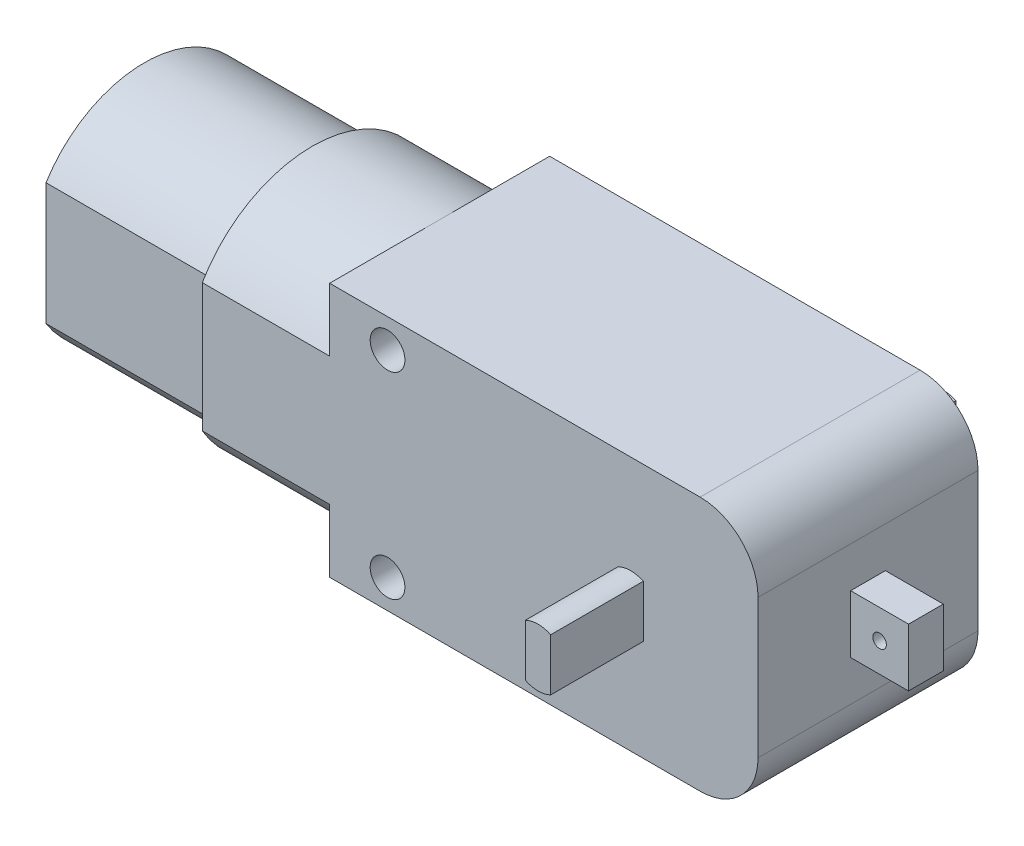
ISO-10303-21;
HEADER;
FILE_DESCRIPTION(('STEP AP214'),'2;1');
FILE_NAME('part.step','',(''),(''),'','','');
FILE_SCHEMA(('AUTOMOTIVE_DESIGN { 1 0 10303 214 1 1 1 1 }'));
ENDSEC;
DATA;
#1=APPLICATION_CONTEXT('core data for automotive mechanical design processes');
#2=APPLICATION_PROTOCOL_DEFINITION('international standard','automotive_design',2000,#1);
#3=PRODUCT_CONTEXT('',#1,'mechanical');
#4=PRODUCT('Part','Part','',(#3));
#5=PRODUCT_RELATED_PRODUCT_CATEGORY('part','',(#4));
#6=PRODUCT_DEFINITION_FORMATION('','',#4);
#7=PRODUCT_DEFINITION_CONTEXT('part definition',#1,'design');
#8=PRODUCT_DEFINITION('design','',#6,#7);
#9=PRODUCT_DEFINITION_SHAPE('','',#8);
#10=(LENGTH_UNIT() NAMED_UNIT(*) SI_UNIT(.MILLI.,.METRE.));
#11=(NAMED_UNIT(*) PLANE_ANGLE_UNIT() SI_UNIT($,.RADIAN.));
#12=(NAMED_UNIT(*) SI_UNIT($,.STERADIAN.) SOLID_ANGLE_UNIT());
#13=UNCERTAINTY_MEASURE_WITH_UNIT(LENGTH_MEASURE(1.E-05),#10,'distance_accuracy_value','');
#14=(GEOMETRIC_REPRESENTATION_CONTEXT(3) GLOBAL_UNCERTAINTY_ASSIGNED_CONTEXT((#13)) GLOBAL_UNIT_ASSIGNED_CONTEXT((#10,
#11,#12)) REPRESENTATION_CONTEXT('',''));
#15=CARTESIAN_POINT('',(0.,0.,0.));
#16=DIRECTION('',(0.,0.,1.));
#17=DIRECTION('',(1.,0.,0.));
#18=AXIS2_PLACEMENT_3D('',#15,#16,#17);
#19=CARTESIAN_POINT('',(-18.5,-11.,19.));
#20=DIRECTION('',(1.,0.,0.));
#21=DIRECTION('',(0.,0.,-1.));
#22=AXIS2_PLACEMENT_3D('',#19,#20,#21);
#23=PLANE('',#22);
#24=CARTESIAN_POINT('',(-18.5,0.,9.5));
#25=DIRECTION('',(-1.,0.,0.));
#26=DIRECTION('',(0.,0.,1.));
#27=AXIS2_PLACEMENT_3D('',#24,#25,#26);
#28=CIRCLE('',#27,11.);
#29=CARTESIAN_POINT('',(-18.5,-5.54526825320471,0.));
#30=VERTEX_POINT('',#29);
#31=CARTESIAN_POINT('',(-18.5,-11.,9.5));
#32=VERTEX_POINT('',#31);
#33=EDGE_CURVE('E51',#30,#32,#28,.T.);
#34=ORIENTED_EDGE('',*,*,#33,.F.);
#35=DIRECTION('',(0.,-1.,0.));
#36=VECTOR('',#35,1.);
#37=CARTESIAN_POINT('',(-18.5,-11.,0.));
#38=LINE('',#37,#36);
#39=CARTESIAN_POINT('',(-18.5,-11.,0.));
#40=VERTEX_POINT('',#39);
#41=EDGE_CURVE('E410',#30,#40,#38,.T.);
#42=ORIENTED_EDGE('',*,*,#41,.T.);
#43=DIRECTION('',(0.,0.,-1.));
#44=VECTOR('',#43,1.);
#45=CARTESIAN_POINT('',(-18.5,-11.,19.));
#46=LINE('',#45,#44);
#47=EDGE_CURVE('E416',#32,#40,#46,.T.);
#48=ORIENTED_EDGE('',*,*,#47,.F.);
#49=EDGE_LOOP('',(#34,#42,#48));
#50=FACE_BOUND('',#49,.T.);
#51=ADVANCED_FACE('F40',(#50),#23,.F.);
#52=CARTESIAN_POINT('',(-18.5,-5.54526825320472,19.));
#53=VERTEX_POINT('',#52);
#54=EDGE_CURVE('E11',#32,#53,#28,.T.);
#55=ORIENTED_EDGE('',*,*,#54,.F.);
#56=CARTESIAN_POINT('',(-18.5,-11.,19.));
#57=VERTEX_POINT('',#56);
#58=EDGE_CURVE('E417',#57,#32,#46,.T.);
#59=ORIENTED_EDGE('',*,*,#58,.F.);
#60=DIRECTION('',(0.,-1.,0.));
#61=VECTOR('',#60,1.);
#62=CARTESIAN_POINT('',(-18.5,-11.,19.));
#63=LINE('',#62,#61);
#64=EDGE_CURVE('E394',#53,#57,#63,.T.);
#65=ORIENTED_EDGE('',*,*,#64,.F.);
#66=EDGE_LOOP('',(#55,#59,#65));
#67=FACE_BOUND('',#66,.T.);
#68=ADVANCED_FACE('F488',(#67),#23,.F.);
#69=CARTESIAN_POINT('',(-18.5,0.,9.5));
#70=DIRECTION('',(-1.,0.,0.));
#71=DIRECTION('',(0.,0.,1.));
#72=AXIS2_PLACEMENT_3D('',#69,#70,#71);
#73=CIRCLE('',#72,11.);
#74=CARTESIAN_POINT('',(-18.5,5.54526825320472,19.));
#75=VERTEX_POINT('',#74);
#76=CARTESIAN_POINT('',(-18.5,11.,9.5));
#77=VERTEX_POINT('',#76);
#78=EDGE_CURVE('E259',#75,#77,#73,.T.);
#79=ORIENTED_EDGE('',*,*,#78,.F.);
#80=CARTESIAN_POINT('',(-18.5,11.,19.));
#81=VERTEX_POINT('',#80);
#82=EDGE_CURVE('E395',#81,#75,#63,.T.);
#83=ORIENTED_EDGE('',*,*,#82,.F.);
#84=DIRECTION('',(0.,0.,-1.));
#85=VECTOR('',#84,1.);
#86=CARTESIAN_POINT('',(-18.5,11.,19.));
#87=LINE('',#86,#85);
#88=EDGE_CURVE('E421',#81,#77,#87,.T.);
#89=ORIENTED_EDGE('',*,*,#88,.T.);
#90=EDGE_LOOP('',(#79,#83,#89));
#91=FACE_BOUND('',#90,.T.);
#92=ADVANCED_FACE('F471',(#91),#23,.F.);
#93=CARTESIAN_POINT('',(13.5,-6.,19.));
#94=DIRECTION('',(0.,0.,1.));
#95=DIRECTION('',(1.,0.,0.));
#96=AXIS2_PLACEMENT_3D('',#93,#94,#95);
#97=PLANE('',#96);
#98=DIRECTION('',(0.,-1.,0.));
#99=VECTOR('',#98,1.);
#100=CARTESIAN_POINT('',(6.41027526411483,-6.,19.));
#101=LINE('',#100,#99);
#102=CARTESIAN_POINT('',(6.41027526411483,2.25,19.));
#103=VERTEX_POINT('',#102);
#104=CARTESIAN_POINT('',(6.41027526411483,-2.25,19.));
#105=VERTEX_POINT('',#104);
#106=EDGE_CURVE('E330',#103,#105,#101,.T.);
#107=ORIENTED_EDGE('',*,*,#106,.F.);
#108=CARTESIAN_POINT('',(7.5,0.,19.));
#109=DIRECTION('',(0.,0.,1.));
#110=DIRECTION('',(1.,0.,0.));
#111=AXIS2_PLACEMENT_3D('',#108,#109,#110);
#112=CIRCLE('',#111,2.5);
#113=CARTESIAN_POINT('',(8.58972473588517,2.25,19.));
#114=VERTEX_POINT('',#113);
#115=EDGE_CURVE('E327',#114,#103,#112,.T.);
#116=ORIENTED_EDGE('',*,*,#115,.F.);
#117=DIRECTION('',(0.,-1.,0.));
#118=VECTOR('',#117,1.);
#119=CARTESIAN_POINT('',(8.58972473588517,-6.,19.));
#120=LINE('',#119,#118);
#121=CARTESIAN_POINT('',(8.58972473588517,-2.25,19.));
#122=VERTEX_POINT('',#121);
#123=EDGE_CURVE('E325',#114,#122,#120,.T.);
#124=ORIENTED_EDGE('',*,*,#123,.T.);
#125=CARTESIAN_POINT('',(7.5,0.,19.));
#126=DIRECTION('',(0.,0.,1.));
#127=DIRECTION('',(1.,0.,0.));
#128=AXIS2_PLACEMENT_3D('',#125,#126,#127);
#129=CIRCLE('',#128,2.5);
#130=EDGE_CURVE('E311',#105,#122,#129,.T.);
#131=ORIENTED_EDGE('',*,*,#130,.F.);
#132=EDGE_LOOP('',(#107,#116,#124,#131));
#133=FACE_BOUND('',#132,.T.);
#134=CARTESIAN_POINT('',(-13.5,8.5,19.));
#135=DIRECTION('',(0.,0.,1.));
#136=DIRECTION('',(1.,0.,0.));
#137=AXIS2_PLACEMENT_3D('',#134,#135,#136);
#138=CIRCLE('',#137,1.5);
#139=CARTESIAN_POINT('',(-12.,8.5,19.));
#140=VERTEX_POINT('',#139);
#141=EDGE_CURVE('E378',#140,#140,#138,.T.);
#142=ORIENTED_EDGE('',*,*,#141,.F.);
#143=EDGE_LOOP('',(#142));
#144=FACE_BOUND('',#143,.T.);
#145=CARTESIAN_POINT('',(13.5,-6.,19.));
#146=DIRECTION('',(0.,0.,1.));
#147=DIRECTION('',(1.,0.,0.));
#148=AXIS2_PLACEMENT_3D('',#145,#146,#147);
#149=CIRCLE('',#148,5.);
#150=CARTESIAN_POINT('',(13.5,-11.,19.));
#151=VERTEX_POINT('',#150);
#152=CARTESIAN_POINT('',(18.5,-6.,19.));
#153=VERTEX_POINT('',#152);
#154=EDGE_CURVE('E384',#151,#153,#149,.T.);
#155=ORIENTED_EDGE('',*,*,#154,.T.);
#156=DIRECTION('',(0.,1.,0.));
#157=VECTOR('',#156,1.);
#158=CARTESIAN_POINT('',(18.5,-6.,19.));
#159=LINE('',#158,#157);
#160=CARTESIAN_POINT('',(18.5,6.,19.));
#161=VERTEX_POINT('',#160);
#162=EDGE_CURVE('E387',#153,#161,#159,.T.);
#163=ORIENTED_EDGE('',*,*,#162,.T.);
#164=CARTESIAN_POINT('',(13.5,6.,19.));
#165=DIRECTION('',(0.,0.,1.));
#166=DIRECTION('',(1.,0.,0.));
#167=AXIS2_PLACEMENT_3D('',#164,#165,#166);
#168=CIRCLE('',#167,5.);
#169=CARTESIAN_POINT('',(13.5,11.,19.));
#170=VERTEX_POINT('',#169);
#171=EDGE_CURVE('E390',#161,#170,#168,.T.);
#172=ORIENTED_EDGE('',*,*,#171,.T.);
#173=DIRECTION('',(-1.,0.,0.));
#174=VECTOR('',#173,1.);
#175=CARTESIAN_POINT('',(-18.5,11.,19.));
#176=LINE('',#175,#174);
#177=EDGE_CURVE('E392',#170,#81,#176,.T.);
#178=ORIENTED_EDGE('',*,*,#177,.T.);
#179=ORIENTED_EDGE('',*,*,#82,.T.);
#180=DIRECTION('',(1.,0.,0.));
#181=VECTOR('',#180,1.);
#182=CARTESIAN_POINT('',(-29.5,5.54526825320472,19.));
#183=LINE('',#182,#181);
#184=CARTESIAN_POINT('',(-29.5,5.54526825320472,19.));
#185=VERTEX_POINT('',#184);
#186=EDGE_CURVE('E281',#185,#75,#183,.T.);
#187=ORIENTED_EDGE('',*,*,#186,.F.);
#188=DIRECTION('',(0.,1.,0.));
#189=VECTOR('',#188,1.);
#190=CARTESIAN_POINT('',(-29.5,0.,19.));
#191=LINE('',#190,#189);
#192=CARTESIAN_POINT('',(-29.5,-5.54526825320472,19.));
#193=VERTEX_POINT('',#192);
#194=EDGE_CURVE('E260',#193,#185,#191,.T.);
#195=ORIENTED_EDGE('',*,*,#194,.F.);
#196=DIRECTION('',(1.,0.,0.));
#197=VECTOR('',#196,1.);
#198=CARTESIAN_POINT('',(-29.5,-5.54526825320472,19.));
#199=LINE('',#198,#197);
#200=EDGE_CURVE('E269',#193,#53,#199,.T.);
#201=ORIENTED_EDGE('',*,*,#200,.T.);
#202=ORIENTED_EDGE('',*,*,#64,.T.);
#203=DIRECTION('',(1.,0.,0.));
#204=VECTOR('',#203,1.);
#205=CARTESIAN_POINT('',(-18.5,-11.,19.));
#206=LINE('',#205,#204);
#207=EDGE_CURVE('E398',#57,#151,#206,.T.);
#208=ORIENTED_EDGE('',*,*,#207,.T.);
#209=EDGE_LOOP('',(#155,#163,#172,#178,#179,#187,#195,#201,#202,#208));
#210=FACE_BOUND('',#209,.T.);
#211=CARTESIAN_POINT('',(-13.5,-8.5,19.));
#212=DIRECTION('',(0.,0.,1.));
#213=DIRECTION('',(-1.,0.,0.));
#214=AXIS2_PLACEMENT_3D('',#211,#212,#213);
#215=CIRCLE('',#214,1.5);
#216=CARTESIAN_POINT('',(-15.,-8.5,19.));
#217=VERTEX_POINT('',#216);
#218=EDGE_CURVE('E372',#217,#217,#215,.T.);
#219=ORIENTED_EDGE('',*,*,#218,.F.);
#220=EDGE_LOOP('',(#219));
#221=FACE_BOUND('',#220,.T.);
#222=ADVANCED_FACE('F465',(#133,#144,#210,#221),#97,.T.);
#223=CARTESIAN_POINT('',(13.5,-6.,0.));
#224=DIRECTION('',(0.,0.,1.));
#225=DIRECTION('',(1.,0.,0.));
#226=AXIS2_PLACEMENT_3D('',#223,#224,#225);
#227=PLANE('',#226);
#228=CARTESIAN_POINT('',(7.5,0.,0.));
#229=DIRECTION('',(0.,0.,1.));
#230=DIRECTION('',(1.,0.,0.));
#231=AXIS2_PLACEMENT_3D('',#228,#229,#230);
#232=CIRCLE('',#231,2.5);
#233=CARTESIAN_POINT('',(8.58972473588517,2.25,0.));
#234=VERTEX_POINT('',#233);
#235=CARTESIAN_POINT('',(6.41027526411483,2.25,0.));
#236=VERTEX_POINT('',#235);
#237=EDGE_CURVE('E438',#234,#236,#232,.T.);
#238=ORIENTED_EDGE('',*,*,#237,.T.);
#239=DIRECTION('',(0.,-1.,0.));
#240=VECTOR('',#239,1.);
#241=CARTESIAN_POINT('',(6.41027526411483,-6.,0.));
#242=LINE('',#241,#240);
#243=CARTESIAN_POINT('',(6.41027526411483,-2.25,0.));
#244=VERTEX_POINT('',#243);
#245=EDGE_CURVE('E44',#236,#244,#242,.T.);
#246=ORIENTED_EDGE('',*,*,#245,.T.);
#247=CARTESIAN_POINT('',(7.5,0.,0.));
#248=DIRECTION('',(0.,0.,1.));
#249=DIRECTION('',(1.,0.,0.));
#250=AXIS2_PLACEMENT_3D('',#247,#248,#249);
#251=CIRCLE('',#250,2.5);
#252=CARTESIAN_POINT('',(8.58972473588517,-2.25,0.));
#253=VERTEX_POINT('',#252);
#254=EDGE_CURVE('E433',#244,#253,#251,.T.);
#255=ORIENTED_EDGE('',*,*,#254,.T.);
#256=DIRECTION('',(0.,-1.,0.));
#257=VECTOR('',#256,1.);
#258=CARTESIAN_POINT('',(8.58972473588517,-6.,0.));
#259=LINE('',#258,#257);
#260=EDGE_CURVE('E436',#234,#253,#259,.T.);
#261=ORIENTED_EDGE('',*,*,#260,.F.);
#262=EDGE_LOOP('',(#238,#246,#255,#261));
#263=FACE_BOUND('',#262,.T.);
#264=CARTESIAN_POINT('',(13.5,-6.,0.));
#265=DIRECTION('',(0.,0.,1.));
#266=DIRECTION('',(1.,0.,0.));
#267=AXIS2_PLACEMENT_3D('',#264,#265,#266);
#268=CIRCLE('',#267,5.);
#269=CARTESIAN_POINT('',(13.5,-11.,0.));
#270=VERTEX_POINT('',#269);
#271=CARTESIAN_POINT('',(18.5,-6.,0.));
#272=VERTEX_POINT('',#271);
#273=EDGE_CURVE('E381',#270,#272,#268,.T.);
#274=ORIENTED_EDGE('',*,*,#273,.F.);
#275=DIRECTION('',(1.,0.,0.));
#276=VECTOR('',#275,1.);
#277=CARTESIAN_POINT('',(-18.5,-11.,0.));
#278=LINE('',#277,#276);
#279=EDGE_CURVE('E388',#40,#270,#278,.T.);
#280=ORIENTED_EDGE('',*,*,#279,.F.);
#281=ORIENTED_EDGE('',*,*,#41,.F.);
#282=DIRECTION('',(1.,0.,0.));
#283=VECTOR('',#282,1.);
#284=CARTESIAN_POINT('',(-29.5,-5.54526825320471,0.));
#285=LINE('',#284,#283);
#286=CARTESIAN_POINT('',(-29.5,-5.54526825320471,0.));
#287=VERTEX_POINT('',#286);
#288=EDGE_CURVE('E275',#287,#30,#285,.T.);
#289=ORIENTED_EDGE('',*,*,#288,.F.);
#290=DIRECTION('',(0.,-1.,0.));
#291=VECTOR('',#290,1.);
#292=CARTESIAN_POINT('',(-29.5,0.,0.));
#293=LINE('',#292,#291);
#294=CARTESIAN_POINT('',(-29.5,5.54526825320471,0.));
#295=VERTEX_POINT('',#294);
#296=EDGE_CURVE('E265',#295,#287,#293,.T.);
#297=ORIENTED_EDGE('',*,*,#296,.F.);
#298=DIRECTION('',(1.,0.,0.));
#299=VECTOR('',#298,1.);
#300=CARTESIAN_POINT('',(-29.5,5.54526825320471,0.));
#301=LINE('',#300,#299);
#302=CARTESIAN_POINT('',(-18.5,5.54526825320471,0.));
#303=VERTEX_POINT('',#302);
#304=EDGE_CURVE('E278',#295,#303,#301,.T.);
#305=ORIENTED_EDGE('',*,*,#304,.T.);
#306=CARTESIAN_POINT('',(-18.5,11.,0.));
#307=VERTEX_POINT('',#306);
#308=EDGE_CURVE('E411',#307,#303,#38,.T.);
#309=ORIENTED_EDGE('',*,*,#308,.F.);
#310=DIRECTION('',(-1.,0.,0.));
#311=VECTOR('',#310,1.);
#312=CARTESIAN_POINT('',(-18.5,11.,0.));
#313=LINE('',#312,#311);
#314=CARTESIAN_POINT('',(13.5,11.,0.));
#315=VERTEX_POINT('',#314);
#316=EDGE_CURVE('E407',#315,#307,#313,.T.);
#317=ORIENTED_EDGE('',*,*,#316,.F.);
#318=CARTESIAN_POINT('',(13.5,6.,0.));
#319=DIRECTION('',(0.,0.,1.));
#320=DIRECTION('',(1.,0.,0.));
#321=AXIS2_PLACEMENT_3D('',#318,#319,#320);
#322=CIRCLE('',#321,5.);
#323=CARTESIAN_POINT('',(18.5,6.,0.));
#324=VERTEX_POINT('',#323);
#325=EDGE_CURVE('E405',#324,#315,#322,.T.);
#326=ORIENTED_EDGE('',*,*,#325,.F.);
#327=DIRECTION('',(0.,1.,0.));
#328=VECTOR('',#327,1.);
#329=CARTESIAN_POINT('',(18.5,-6.,0.));
#330=LINE('',#329,#328);
#331=EDGE_CURVE('E403',#272,#324,#330,.T.);
#332=ORIENTED_EDGE('',*,*,#331,.F.);
#333=EDGE_LOOP('',(#274,#280,#281,#289,#297,#305,#309,#317,#326,#332));
#334=FACE_BOUND('',#333,.T.);
#335=CARTESIAN_POINT('',(-13.5,8.5,0.));
#336=DIRECTION('',(0.,0.,1.));
#337=DIRECTION('',(1.,0.,0.));
#338=AXIS2_PLACEMENT_3D('',#335,#336,#337);
#339=CIRCLE('',#338,1.5);
#340=CARTESIAN_POINT('',(-12.,8.5,0.));
#341=VERTEX_POINT('',#340);
#342=EDGE_CURVE('E375',#341,#341,#339,.T.);
#343=ORIENTED_EDGE('',*,*,#342,.T.);
#344=EDGE_LOOP('',(#343));
#345=FACE_BOUND('',#344,.T.);
#346=CARTESIAN_POINT('',(-13.5,-8.5,0.));
#347=DIRECTION('',(0.,0.,1.));
#348=DIRECTION('',(-1.,0.,0.));
#349=AXIS2_PLACEMENT_3D('',#346,#347,#348);
#350=CIRCLE('',#349,1.5);
#351=CARTESIAN_POINT('',(-15.,-8.5,0.));
#352=VERTEX_POINT('',#351);
#353=EDGE_CURVE('E371',#352,#352,#350,.T.);
#354=ORIENTED_EDGE('',*,*,#353,.T.);
#355=EDGE_LOOP('',(#354));
#356=FACE_BOUND('',#355,.T.);
#357=ADVANCED_FACE('F453',(#263,#334,#345,#356),#227,.F.);
#358=CARTESIAN_POINT('',(13.5,-6.,19.));
#359=DIRECTION('',(0.,0.,-1.));
#360=DIRECTION('',(-1.,0.,0.));
#361=AXIS2_PLACEMENT_3D('',#358,#359,#360);
#362=CYLINDRICAL_SURFACE('',#361,5.);
#363=ORIENTED_EDGE('',*,*,#273,.T.);
#364=DIRECTION('',(0.,0.,-1.));
#365=VECTOR('',#364,1.);
#366=CARTESIAN_POINT('',(18.5,-6.,19.));
#367=LINE('',#366,#365);
#368=EDGE_CURVE('E430',#153,#272,#367,.T.);
#369=ORIENTED_EDGE('',*,*,#368,.F.);
#370=ORIENTED_EDGE('',*,*,#154,.F.);
#371=DIRECTION('',(0.,0.,-1.));
#372=VECTOR('',#371,1.);
#373=CARTESIAN_POINT('',(13.5,-11.,19.));
#374=LINE('',#373,#372);
#375=EDGE_CURVE('E400',#151,#270,#374,.T.);
#376=ORIENTED_EDGE('',*,*,#375,.T.);
#377=EDGE_LOOP('',(#363,#369,#370,#376));
#378=FACE_BOUND('',#377,.T.);
#379=ADVANCED_FACE('F42',(#378),#362,.T.);
#380=CARTESIAN_POINT('',(18.5,-6.,19.));
#381=DIRECTION('',(-1.,0.,0.));
#382=DIRECTION('',(0.,0.,1.));
#383=AXIS2_PLACEMENT_3D('',#380,#381,#382);
#384=PLANE('',#383);
#385=DIRECTION('',(0.,0.,-1.));
#386=VECTOR('',#385,1.);
#387=CARTESIAN_POINT('',(18.5,2.5,0.));
#388=LINE('',#387,#386);
#389=CARTESIAN_POINT('',(18.5,2.5,11.));
#390=VERTEX_POINT('',#389);
#391=CARTESIAN_POINT('',(18.5,2.5,8.));
#392=VERTEX_POINT('',#391);
#393=EDGE_CURVE('E353',#390,#392,#388,.T.);
#394=ORIENTED_EDGE('',*,*,#393,.T.);
#395=DIRECTION('',(0.,-1.,0.));
#396=VECTOR('',#395,1.);
#397=CARTESIAN_POINT('',(18.5,0.,8.));
#398=LINE('',#397,#396);
#399=CARTESIAN_POINT('',(18.5,-2.5,8.));
#400=VERTEX_POINT('',#399);
#401=EDGE_CURVE('E339',#392,#400,#398,.T.);
#402=ORIENTED_EDGE('',*,*,#401,.T.);
#403=DIRECTION('',(0.,0.,-1.));
#404=VECTOR('',#403,1.);
#405=CARTESIAN_POINT('',(18.5,-2.5,0.));
#406=LINE('',#405,#404);
#407=CARTESIAN_POINT('',(18.5,-2.5,11.));
#408=VERTEX_POINT('',#407);
#409=EDGE_CURVE('E344',#408,#400,#406,.T.);
#410=ORIENTED_EDGE('',*,*,#409,.F.);
#411=DIRECTION('',(0.,-1.,0.));
#412=VECTOR('',#411,1.);
#413=CARTESIAN_POINT('',(18.5,0.,11.));
#414=LINE('',#413,#412);
#415=EDGE_CURVE('E355',#390,#408,#414,.T.);
#416=ORIENTED_EDGE('',*,*,#415,.F.);
#417=EDGE_LOOP('',(#394,#402,#410,#416));
#418=FACE_BOUND('',#417,.T.);
#419=ORIENTED_EDGE('',*,*,#331,.T.);
#420=DIRECTION('',(0.,0.,-1.));
#421=VECTOR('',#420,1.);
#422=CARTESIAN_POINT('',(18.5,6.,19.));
#423=LINE('',#422,#421);
#424=EDGE_CURVE('E427',#161,#324,#423,.T.);
#425=ORIENTED_EDGE('',*,*,#424,.F.);
#426=ORIENTED_EDGE('',*,*,#162,.F.);
#427=ORIENTED_EDGE('',*,*,#368,.T.);
#428=EDGE_LOOP('',(#419,#425,#426,#427));
#429=FACE_BOUND('',#428,.T.);
#430=ADVANCED_FACE('F512',(#418,#429),#384,.F.);
#431=CARTESIAN_POINT('',(13.5,6.,19.));
#432=DIRECTION('',(0.,0.,-1.));
#433=DIRECTION('',(-1.,0.,0.));
#434=AXIS2_PLACEMENT_3D('',#431,#432,#433);
#435=CYLINDRICAL_SURFACE('',#434,5.);
#436=ORIENTED_EDGE('',*,*,#325,.T.);
#437=DIRECTION('',(0.,0.,-1.));
#438=VECTOR('',#437,1.);
#439=CARTESIAN_POINT('',(13.5,11.,19.));
#440=LINE('',#439,#438);
#441=EDGE_CURVE('E424',#170,#315,#440,.T.);
#442=ORIENTED_EDGE('',*,*,#441,.F.);
#443=ORIENTED_EDGE('',*,*,#171,.F.);
#444=ORIENTED_EDGE('',*,*,#424,.T.);
#445=EDGE_LOOP('',(#436,#442,#443,#444));
#446=FACE_BOUND('',#445,.T.);
#447=ADVANCED_FACE('F485',(#446),#435,.T.);
#448=CARTESIAN_POINT('',(-18.5,11.,19.));
#449=DIRECTION('',(0.,-1.,0.));
#450=DIRECTION('',(0.,0.,-1.));
#451=AXIS2_PLACEMENT_3D('',#448,#449,#450);
#452=PLANE('',#451);
#453=ORIENTED_EDGE('',*,*,#316,.T.);
#454=EDGE_CURVE('E420',#77,#307,#87,.T.);
#455=ORIENTED_EDGE('',*,*,#454,.F.);
#456=ORIENTED_EDGE('',*,*,#88,.F.);
#457=ORIENTED_EDGE('',*,*,#177,.F.);
#458=ORIENTED_EDGE('',*,*,#441,.T.);
#459=EDGE_LOOP('',(#453,#455,#456,#457,#458));
#460=FACE_BOUND('',#459,.T.);
#461=ADVANCED_FACE('F473',(#460),#452,.F.);
#462=EDGE_CURVE('E49',#77,#303,#73,.T.);
#463=ORIENTED_EDGE('',*,*,#462,.F.);
#464=ORIENTED_EDGE('',*,*,#454,.T.);
#465=ORIENTED_EDGE('',*,*,#308,.T.);
#466=EDGE_LOOP('',(#463,#464,#465));
#467=FACE_BOUND('',#466,.T.);
#468=ADVANCED_FACE('F474',(#467),#23,.F.);
#469=CARTESIAN_POINT('',(-18.5,-11.,19.));
#470=DIRECTION('',(0.,1.,0.));
#471=DIRECTION('',(0.,0.,1.));
#472=AXIS2_PLACEMENT_3D('',#469,#470,#471);
#473=PLANE('',#472);
#474=ORIENTED_EDGE('',*,*,#279,.T.);
#475=ORIENTED_EDGE('',*,*,#375,.F.);
#476=ORIENTED_EDGE('',*,*,#207,.F.);
#477=ORIENTED_EDGE('',*,*,#58,.T.);
#478=ORIENTED_EDGE('',*,*,#47,.T.);
#479=EDGE_LOOP('',(#474,#475,#476,#477,#478));
#480=FACE_BOUND('',#479,.T.);
#481=ADVANCED_FACE('F476',(#480),#473,.F.);
#482=CARTESIAN_POINT('',(-13.5,8.5,19.));
#483=DIRECTION('',(0.,0.,-1.));
#484=DIRECTION('',(-1.,0.,0.));
#485=AXIS2_PLACEMENT_3D('',#482,#483,#484);
#486=CYLINDRICAL_SURFACE('',#485,1.5);
#487=ORIENTED_EDGE('',*,*,#141,.T.);
#488=EDGE_LOOP('',(#487));
#489=FACE_BOUND('',#488,.T.);
#490=ORIENTED_EDGE('',*,*,#342,.F.);
#491=EDGE_LOOP('',(#490));
#492=FACE_BOUND('',#491,.T.);
#493=ADVANCED_FACE('F482',(#489,#492),#486,.F.);
#494=CARTESIAN_POINT('',(-13.5,-8.5,19.));
#495=DIRECTION('',(0.,0.,-1.));
#496=DIRECTION('',(-1.,0.,0.));
#497=AXIS2_PLACEMENT_3D('',#494,#495,#496);
#498=CYLINDRICAL_SURFACE('',#497,1.5);
#499=ORIENTED_EDGE('',*,*,#218,.T.);
#500=EDGE_LOOP('',(#499));
#501=FACE_BOUND('',#500,.T.);
#502=ORIENTED_EDGE('',*,*,#353,.F.);
#503=EDGE_LOOP('',(#502));
#504=FACE_BOUND('',#503,.T.);
#505=ADVANCED_FACE('F565',(#501,#504),#498,.F.);
#506=CARTESIAN_POINT('',(23.5,0.,8.));
#507=DIRECTION('',(0.,0.,-1.));
#508=DIRECTION('',(-1.,0.,0.));
#509=AXIS2_PLACEMENT_3D('',#506,#507,#508);
#510=PLANE('',#509);
#511=CARTESIAN_POINT('',(21.,0.,8.));
#512=DIRECTION('',(0.,0.,-1.));
#513=DIRECTION('',(-1.,0.,0.));
#514=AXIS2_PLACEMENT_3D('',#511,#512,#513);
#515=CIRCLE('',#514,0.584411025794206);
#516=CARTESIAN_POINT('',(20.4155889742058,0.,8.));
#517=VERTEX_POINT('',#516);
#518=EDGE_CURVE('E336',#517,#517,#515,.T.);
#519=ORIENTED_EDGE('',*,*,#518,.F.);
#520=EDGE_LOOP('',(#519));
#521=FACE_BOUND('',#520,.T.);
#522=ORIENTED_EDGE('',*,*,#401,.F.);
#523=DIRECTION('',(-1.,0.,0.));
#524=VECTOR('',#523,1.);
#525=CARTESIAN_POINT('',(23.5,2.5,8.));
#526=LINE('',#525,#524);
#527=CARTESIAN_POINT('',(23.5,2.5,8.));
#528=VERTEX_POINT('',#527);
#529=EDGE_CURVE('E368',#528,#392,#526,.T.);
#530=ORIENTED_EDGE('',*,*,#529,.F.);
#531=DIRECTION('',(0.,-1.,0.));
#532=VECTOR('',#531,1.);
#533=CARTESIAN_POINT('',(23.5,0.,8.));
#534=LINE('',#533,#532);
#535=CARTESIAN_POINT('',(23.5,-2.5,8.));
#536=VERTEX_POINT('',#535);
#537=EDGE_CURVE('E340',#528,#536,#534,.T.);
#538=ORIENTED_EDGE('',*,*,#537,.T.);
#539=DIRECTION('',(-1.,0.,0.));
#540=VECTOR('',#539,1.);
#541=CARTESIAN_POINT('',(23.5,-2.5,8.));
#542=LINE('',#541,#540);
#543=EDGE_CURVE('E351',#536,#400,#542,.T.);
#544=ORIENTED_EDGE('',*,*,#543,.T.);
#545=EDGE_LOOP('',(#522,#530,#538,#544));
#546=FACE_BOUND('',#545,.T.);
#547=ADVANCED_FACE('F534',(#521,#546),#510,.T.);
#548=CARTESIAN_POINT('',(23.5,2.5,0.));
#549=DIRECTION('',(0.,1.,0.));
#550=DIRECTION('',(0.,0.,1.));
#551=AXIS2_PLACEMENT_3D('',#548,#549,#550);
#552=PLANE('',#551);
#553=ORIENTED_EDGE('',*,*,#393,.F.);
#554=DIRECTION('',(-1.,0.,0.));
#555=VECTOR('',#554,1.);
#556=CARTESIAN_POINT('',(23.5,2.5,11.));
#557=LINE('',#556,#555);
#558=CARTESIAN_POINT('',(23.5,2.5,11.));
#559=VERTEX_POINT('',#558);
#560=EDGE_CURVE('E365',#559,#390,#557,.T.);
#561=ORIENTED_EDGE('',*,*,#560,.F.);
#562=DIRECTION('',(0.,0.,-1.));
#563=VECTOR('',#562,1.);
#564=CARTESIAN_POINT('',(23.5,2.5,0.));
#565=LINE('',#564,#563);
#566=EDGE_CURVE('E343',#559,#528,#565,.T.);
#567=ORIENTED_EDGE('',*,*,#566,.T.);
#568=ORIENTED_EDGE('',*,*,#529,.T.);
#569=EDGE_LOOP('',(#553,#561,#567,#568));
#570=FACE_BOUND('',#569,.T.);
#571=ADVANCED_FACE('F530',(#570),#552,.T.);
#572=CARTESIAN_POINT('',(23.5,0.,11.));
#573=DIRECTION('',(0.,0.,-1.));
#574=DIRECTION('',(-1.,0.,0.));
#575=AXIS2_PLACEMENT_3D('',#572,#573,#574);
#576=PLANE('',#575);
#577=CARTESIAN_POINT('',(21.,0.,11.));
#578=DIRECTION('',(0.,0.,1.));
#579=DIRECTION('',(1.,0.,0.));
#580=AXIS2_PLACEMENT_3D('',#577,#578,#579);
#581=CIRCLE('',#580,0.584411025794206);
#582=CARTESIAN_POINT('',(21.5844110257942,0.,11.));
#583=VERTEX_POINT('',#582);
#584=EDGE_CURVE('E333',#583,#583,#581,.T.);
#585=ORIENTED_EDGE('',*,*,#584,.F.);
#586=EDGE_LOOP('',(#585));
#587=FACE_BOUND('',#586,.T.);
#588=ORIENTED_EDGE('',*,*,#415,.T.);
#589=DIRECTION('',(-1.,0.,0.));
#590=VECTOR('',#589,1.);
#591=CARTESIAN_POINT('',(23.5,-2.5,11.));
#592=LINE('',#591,#590);
#593=CARTESIAN_POINT('',(23.5,-2.5,11.));
#594=VERTEX_POINT('',#593);
#595=EDGE_CURVE('E362',#594,#408,#592,.T.);
#596=ORIENTED_EDGE('',*,*,#595,.F.);
#597=DIRECTION('',(0.,-1.,0.));
#598=VECTOR('',#597,1.);
#599=CARTESIAN_POINT('',(23.5,0.,11.));
#600=LINE('',#599,#598);
#601=EDGE_CURVE('E347',#559,#594,#600,.T.);
#602=ORIENTED_EDGE('',*,*,#601,.F.);
#603=ORIENTED_EDGE('',*,*,#560,.T.);
#604=EDGE_LOOP('',(#588,#596,#602,#603));
#605=FACE_BOUND('',#604,.T.);
#606=ADVANCED_FACE('F541',(#587,#605),#576,.F.);
#607=CARTESIAN_POINT('',(23.5,-2.5,0.));
#608=DIRECTION('',(0.,1.,0.));
#609=DIRECTION('',(0.,0.,1.));
#610=AXIS2_PLACEMENT_3D('',#607,#608,#609);
#611=PLANE('',#610);
#612=ORIENTED_EDGE('',*,*,#409,.T.);
#613=ORIENTED_EDGE('',*,*,#543,.F.);
#614=DIRECTION('',(0.,0.,-1.));
#615=VECTOR('',#614,1.);
#616=CARTESIAN_POINT('',(23.5,-2.5,0.));
#617=LINE('',#616,#615);
#618=EDGE_CURVE('E349',#594,#536,#617,.T.);
#619=ORIENTED_EDGE('',*,*,#618,.F.);
#620=ORIENTED_EDGE('',*,*,#595,.T.);
#621=EDGE_LOOP('',(#612,#613,#619,#620));
#622=FACE_BOUND('',#621,.T.);
#623=ADVANCED_FACE('F538',(#622),#611,.F.);
#624=CARTESIAN_POINT('',(23.5,0.,0.));
#625=DIRECTION('',(1.,0.,0.));
#626=DIRECTION('',(0.,0.,-1.));
#627=AXIS2_PLACEMENT_3D('',#624,#625,#626);
#628=PLANE('',#627);
#629=ORIENTED_EDGE('',*,*,#537,.F.);
#630=ORIENTED_EDGE('',*,*,#566,.F.);
#631=ORIENTED_EDGE('',*,*,#601,.T.);
#632=ORIENTED_EDGE('',*,*,#618,.T.);
#633=EDGE_LOOP('',(#629,#630,#631,#632));
#634=FACE_BOUND('',#633,.T.);
#635=ADVANCED_FACE('F544',(#634),#628,.T.);
#636=CARTESIAN_POINT('',(21.,0.,6.));
#637=DIRECTION('',(0.,0.,1.));
#638=DIRECTION('',(1.,0.,0.));
#639=AXIS2_PLACEMENT_3D('',#636,#637,#638);
#640=CYLINDRICAL_SURFACE('',#639,0.584411025794206);
#641=ORIENTED_EDGE('',*,*,#518,.T.);
#642=EDGE_LOOP('',(#641));
#643=FACE_BOUND('',#642,.T.);
#644=ORIENTED_EDGE('',*,*,#584,.T.);
#645=EDGE_LOOP('',(#644));
#646=FACE_BOUND('',#645,.T.);
#647=ADVANCED_FACE('F546',(#643,#646),#640,.F.);
#648=CARTESIAN_POINT('',(0.,0.,-8.));
#649=DIRECTION('',(0.,0.,1.));
#650=DIRECTION('',(1.,0.,0.));
#651=AXIS2_PLACEMENT_3D('',#648,#649,#650);
#652=PLANE('',#651);
#653=DIRECTION('',(0.,-1.,0.));
#654=VECTOR('',#653,1.);
#655=CARTESIAN_POINT('',(6.41027526411483,0.,-8.));
#656=LINE('',#655,#654);
#657=CARTESIAN_POINT('',(6.41027526411483,2.25,-8.));
#658=VERTEX_POINT('',#657);
#659=CARTESIAN_POINT('',(6.41027526411483,-2.25,-8.));
#660=VERTEX_POINT('',#659);
#661=EDGE_CURVE('E296',#658,#660,#656,.T.);
#662=ORIENTED_EDGE('',*,*,#661,.F.);
#663=CARTESIAN_POINT('',(7.5,0.,-8.));
#664=DIRECTION('',(0.,0.,1.));
#665=DIRECTION('',(1.,0.,0.));
#666=AXIS2_PLACEMENT_3D('',#663,#664,#665);
#667=CIRCLE('',#666,2.5);
#668=CARTESIAN_POINT('',(8.58972473588517,2.25,-8.));
#669=VERTEX_POINT('',#668);
#670=EDGE_CURVE('E304',#669,#658,#667,.T.);
#671=ORIENTED_EDGE('',*,*,#670,.F.);
#672=DIRECTION('',(0.,-1.,0.));
#673=VECTOR('',#672,1.);
#674=CARTESIAN_POINT('',(8.58972473588517,0.,-8.));
#675=LINE('',#674,#673);
#676=CARTESIAN_POINT('',(8.58972473588517,-2.25,-8.));
#677=VERTEX_POINT('',#676);
#678=EDGE_CURVE('E302',#669,#677,#675,.T.);
#679=ORIENTED_EDGE('',*,*,#678,.T.);
#680=CARTESIAN_POINT('',(7.5,0.,-8.));
#681=DIRECTION('',(0.,0.,1.));
#682=DIRECTION('',(1.,0.,0.));
#683=AXIS2_PLACEMENT_3D('',#680,#681,#682);
#684=CIRCLE('',#683,2.5);
#685=EDGE_CURVE('E299',#660,#677,#684,.T.);
#686=ORIENTED_EDGE('',*,*,#685,.F.);
#687=EDGE_LOOP('',(#662,#671,#679,#686));
#688=FACE_BOUND('',#687,.T.);
#689=ADVANCED_FACE('F552',(#688),#652,.F.);
#690=CARTESIAN_POINT('',(7.5,0.,-8.));
#691=DIRECTION('',(0.,0.,1.));
#692=DIRECTION('',(1.,0.,0.));
#693=AXIS2_PLACEMENT_3D('',#690,#691,#692);
#694=CYLINDRICAL_SURFACE('',#693,2.5);
#695=ORIENTED_EDGE('',*,*,#254,.F.);
#696=DIRECTION('',(0.,0.,1.));
#697=VECTOR('',#696,1.);
#698=CARTESIAN_POINT('',(6.41027526411483,-2.25,-8.));
#699=LINE('',#698,#697);
#700=EDGE_CURVE('E320',#660,#244,#699,.T.);
#701=ORIENTED_EDGE('',*,*,#700,.F.);
#702=ORIENTED_EDGE('',*,*,#685,.T.);
#703=DIRECTION('',(0.,0.,1.));
#704=VECTOR('',#703,1.);
#705=CARTESIAN_POINT('',(8.58972473588517,-2.25,-8.));
#706=LINE('',#705,#704);
#707=EDGE_CURVE('E317',#677,#253,#706,.T.);
#708=ORIENTED_EDGE('',*,*,#707,.T.);
#709=EDGE_LOOP('',(#695,#701,#702,#708));
#710=FACE_BOUND('',#709,.T.);
#711=ADVANCED_FACE('F649',(#710),#694,.T.);
#712=CARTESIAN_POINT('',(8.58972473588517,0.,-8.));
#713=DIRECTION('',(-1.,0.,0.));
#714=DIRECTION('',(0.,0.,1.));
#715=AXIS2_PLACEMENT_3D('',#712,#713,#714);
#716=PLANE('',#715);
#717=DIRECTION('',(0.,0.,1.));
#718=VECTOR('',#717,1.);
#719=CARTESIAN_POINT('',(8.58972473588517,2.25,-8.));
#720=LINE('',#719,#718);
#721=EDGE_CURVE('E313',#669,#234,#720,.T.);
#722=ORIENTED_EDGE('',*,*,#721,.T.);
#723=ORIENTED_EDGE('',*,*,#260,.T.);
#724=ORIENTED_EDGE('',*,*,#707,.F.);
#725=ORIENTED_EDGE('',*,*,#678,.F.);
#726=EDGE_LOOP('',(#722,#723,#724,#725));
#727=FACE_BOUND('',#726,.T.);
#728=ADVANCED_FACE('F659',(#727),#716,.F.);
#729=CARTESIAN_POINT('',(7.5,0.,-8.));
#730=DIRECTION('',(0.,0.,1.));
#731=DIRECTION('',(1.,0.,0.));
#732=AXIS2_PLACEMENT_3D('',#729,#730,#731);
#733=CYLINDRICAL_SURFACE('',#732,2.5);
#734=ORIENTED_EDGE('',*,*,#237,.F.);
#735=ORIENTED_EDGE('',*,*,#721,.F.);
#736=ORIENTED_EDGE('',*,*,#670,.T.);
#737=DIRECTION('',(0.,0.,1.));
#738=VECTOR('',#737,1.);
#739=CARTESIAN_POINT('',(6.41027526411483,2.25,-8.));
#740=LINE('',#739,#738);
#741=EDGE_CURVE('E308',#658,#236,#740,.T.);
#742=ORIENTED_EDGE('',*,*,#741,.T.);
#743=EDGE_LOOP('',(#734,#735,#736,#742));
#744=FACE_BOUND('',#743,.T.);
#745=ADVANCED_FACE('F670',(#744),#733,.T.);
#746=CARTESIAN_POINT('',(6.41027526411483,0.,-8.));
#747=DIRECTION('',(-1.,0.,0.));
#748=DIRECTION('',(0.,0.,1.));
#749=AXIS2_PLACEMENT_3D('',#746,#747,#748);
#750=PLANE('',#749);
#751=ORIENTED_EDGE('',*,*,#245,.F.);
#752=ORIENTED_EDGE('',*,*,#741,.F.);
#753=ORIENTED_EDGE('',*,*,#661,.T.);
#754=ORIENTED_EDGE('',*,*,#700,.T.);
#755=EDGE_LOOP('',(#751,#752,#753,#754));
#756=FACE_BOUND('',#755,.T.);
#757=ADVANCED_FACE('F681',(#756),#750,.T.);
#758=CARTESIAN_POINT('',(6.41027526411483,2.25,27.));
#759=VERTEX_POINT('',#758);
#760=EDGE_CURVE('E312',#103,#759,#740,.T.);
#761=ORIENTED_EDGE('',*,*,#760,.F.);
#762=ORIENTED_EDGE('',*,*,#106,.T.);
#763=CARTESIAN_POINT('',(6.41027526411483,-2.25,27.));
#764=VERTEX_POINT('',#763);
#765=EDGE_CURVE('E307',#105,#764,#699,.T.);
#766=ORIENTED_EDGE('',*,*,#765,.T.);
#767=DIRECTION('',(0.,-1.,0.));
#768=VECTOR('',#767,1.);
#769=CARTESIAN_POINT('',(6.41027526411483,0.,27.));
#770=LINE('',#769,#768);
#771=EDGE_CURVE('E284',#759,#764,#770,.T.);
#772=ORIENTED_EDGE('',*,*,#771,.F.);
#773=EDGE_LOOP('',(#761,#762,#766,#772));
#774=FACE_BOUND('',#773,.T.);
#775=ADVANCED_FACE('F692',(#774),#750,.T.);
#776=CARTESIAN_POINT('',(8.58972473588517,2.25,27.));
#777=VERTEX_POINT('',#776);
#778=EDGE_CURVE('E316',#114,#777,#720,.T.);
#779=ORIENTED_EDGE('',*,*,#778,.F.);
#780=ORIENTED_EDGE('',*,*,#115,.T.);
#781=ORIENTED_EDGE('',*,*,#760,.T.);
#782=CARTESIAN_POINT('',(7.5,0.,27.));
#783=DIRECTION('',(0.,0.,1.));
#784=DIRECTION('',(1.,0.,0.));
#785=AXIS2_PLACEMENT_3D('',#782,#783,#784);
#786=CIRCLE('',#785,2.5);
#787=EDGE_CURVE('E293',#777,#759,#786,.T.);
#788=ORIENTED_EDGE('',*,*,#787,.F.);
#789=EDGE_LOOP('',(#779,#780,#781,#788));
#790=FACE_BOUND('',#789,.T.);
#791=ADVANCED_FACE('F684',(#790),#733,.T.);
#792=ORIENTED_EDGE('',*,*,#123,.F.);
#793=ORIENTED_EDGE('',*,*,#778,.T.);
#794=DIRECTION('',(0.,-1.,0.));
#795=VECTOR('',#794,1.);
#796=CARTESIAN_POINT('',(8.58972473588517,0.,27.));
#797=LINE('',#796,#795);
#798=CARTESIAN_POINT('',(8.58972473588517,-2.25,27.));
#799=VERTEX_POINT('',#798);
#800=EDGE_CURVE('E290',#777,#799,#797,.T.);
#801=ORIENTED_EDGE('',*,*,#800,.T.);
#802=EDGE_CURVE('E319',#122,#799,#706,.T.);
#803=ORIENTED_EDGE('',*,*,#802,.F.);
#804=EDGE_LOOP('',(#792,#793,#801,#803));
#805=FACE_BOUND('',#804,.T.);
#806=ADVANCED_FACE('F673',(#805),#716,.F.);
#807=ORIENTED_EDGE('',*,*,#765,.F.);
#808=ORIENTED_EDGE('',*,*,#130,.T.);
#809=ORIENTED_EDGE('',*,*,#802,.T.);
#810=CARTESIAN_POINT('',(7.5,0.,27.));
#811=DIRECTION('',(0.,0.,1.));
#812=DIRECTION('',(1.,0.,0.));
#813=AXIS2_PLACEMENT_3D('',#810,#811,#812);
#814=CIRCLE('',#813,2.5);
#815=EDGE_CURVE('E287',#764,#799,#814,.T.);
#816=ORIENTED_EDGE('',*,*,#815,.F.);
#817=EDGE_LOOP('',(#807,#808,#809,#816));
#818=FACE_BOUND('',#817,.T.);
#819=ADVANCED_FACE('F662',(#818),#694,.T.);
#820=CARTESIAN_POINT('',(0.,0.,27.));
#821=DIRECTION('',(0.,0.,1.));
#822=DIRECTION('',(1.,0.,0.));
#823=AXIS2_PLACEMENT_3D('',#820,#821,#822);
#824=PLANE('',#823);
#825=ORIENTED_EDGE('',*,*,#771,.T.);
#826=ORIENTED_EDGE('',*,*,#815,.T.);
#827=ORIENTED_EDGE('',*,*,#800,.F.);
#828=ORIENTED_EDGE('',*,*,#787,.T.);
#829=EDGE_LOOP('',(#825,#826,#827,#828));
#830=FACE_BOUND('',#829,.T.);
#831=ADVANCED_FACE('F725',(#830),#824,.T.);
#832=CARTESIAN_POINT('',(-29.5,0.,9.5));
#833=DIRECTION('',(1.,0.,0.));
#834=DIRECTION('',(0.,0.,-1.));
#835=AXIS2_PLACEMENT_3D('',#832,#833,#834);
#836=CYLINDRICAL_SURFACE('',#835,11.);
#837=ORIENTED_EDGE('',*,*,#78,.T.);
#838=ORIENTED_EDGE('',*,*,#462,.T.);
#839=ORIENTED_EDGE('',*,*,#304,.F.);
#840=CARTESIAN_POINT('',(-29.5,0.,9.5));
#841=DIRECTION('',(-1.,0.,0.));
#842=DIRECTION('',(0.,0.,1.));
#843=AXIS2_PLACEMENT_3D('',#840,#841,#842);
#844=CIRCLE('',#843,11.);
#845=EDGE_CURVE('E263',#185,#295,#844,.T.);
#846=ORIENTED_EDGE('',*,*,#845,.F.);
#847=ORIENTED_EDGE('',*,*,#186,.T.);
#848=EDGE_LOOP('',(#837,#838,#839,#846,#847));
#849=FACE_BOUND('',#848,.T.);
#850=ADVANCED_FACE('F446',(#849),#836,.T.);
#851=CARTESIAN_POINT('',(-29.5,0.,9.5));
#852=DIRECTION('',(1.,0.,0.));
#853=DIRECTION('',(0.,0.,-1.));
#854=AXIS2_PLACEMENT_3D('',#851,#852,#853);
#855=CYLINDRICAL_SURFACE('',#854,11.);
#856=ORIENTED_EDGE('',*,*,#33,.T.);
#857=ORIENTED_EDGE('',*,*,#54,.T.);
#858=ORIENTED_EDGE('',*,*,#200,.F.);
#859=CARTESIAN_POINT('',(-29.5,0.,9.5));
#860=DIRECTION('',(-1.,0.,0.));
#861=DIRECTION('',(0.,0.,1.));
#862=AXIS2_PLACEMENT_3D('',#859,#860,#861);
#863=CIRCLE('',#862,11.);
#864=EDGE_CURVE('E267',#287,#193,#863,.T.);
#865=ORIENTED_EDGE('',*,*,#864,.F.);
#866=ORIENTED_EDGE('',*,*,#288,.T.);
#867=EDGE_LOOP('',(#856,#857,#858,#865,#866));
#868=FACE_BOUND('',#867,.T.);
#869=ADVANCED_FACE('F507',(#868),#855,.T.);
#870=CARTESIAN_POINT('',(-29.5,0.,0.));
#871=DIRECTION('',(-1.,0.,0.));
#872=DIRECTION('',(0.,0.,1.));
#873=AXIS2_PLACEMENT_3D('',#870,#871,#872);
#874=PLANE('',#873);
#875=DIRECTION('',(0.,1.,0.));
#876=VECTOR('',#875,1.);
#877=CARTESIAN_POINT('',(-29.5,-5.26782687642638,18.));
#878=LINE('',#877,#876);
#879=CARTESIAN_POINT('',(-29.5,-5.26782687642638,18.));
#880=VERTEX_POINT('',#879);
#881=CARTESIAN_POINT('',(-29.5,5.26782687642638,18.));
#882=VERTEX_POINT('',#881);
#883=EDGE_CURVE('E58',#880,#882,#878,.T.);
#884=ORIENTED_EDGE('',*,*,#883,.F.);
#885=CARTESIAN_POINT('',(-29.5,0.,9.5));
#886=DIRECTION('',(-1.,0.,0.));
#887=DIRECTION('',(0.,0.,1.));
#888=AXIS2_PLACEMENT_3D('',#885,#886,#887);
#889=CIRCLE('',#888,10.);
#890=CARTESIAN_POINT('',(-29.5,-5.26782687642637,1.));
#891=VERTEX_POINT('',#890);
#892=EDGE_CURVE('E62',#891,#880,#889,.T.);
#893=ORIENTED_EDGE('',*,*,#892,.F.);
#894=DIRECTION('',(0.,-1.,0.));
#895=VECTOR('',#894,1.);
#896=CARTESIAN_POINT('',(-29.5,5.26782687642637,1.));
#897=LINE('',#896,#895);
#898=CARTESIAN_POINT('',(-29.5,5.26782687642637,1.));
#899=VERTEX_POINT('',#898);
#900=EDGE_CURVE('E251',#899,#891,#897,.T.);
#901=ORIENTED_EDGE('',*,*,#900,.F.);
#902=CARTESIAN_POINT('',(-29.5,0.,9.5));
#903=DIRECTION('',(-1.,0.,0.));
#904=DIRECTION('',(0.,0.,1.));
#905=AXIS2_PLACEMENT_3D('',#902,#903,#904);
#906=CIRCLE('',#905,10.);
#907=EDGE_CURVE('E248',#882,#899,#906,.T.);
#908=ORIENTED_EDGE('',*,*,#907,.F.);
#909=EDGE_LOOP('',(#884,#893,#901,#908));
#910=FACE_BOUND('',#909,.T.);
#911=ORIENTED_EDGE('',*,*,#194,.T.);
#912=ORIENTED_EDGE('',*,*,#845,.T.);
#913=ORIENTED_EDGE('',*,*,#296,.T.);
#914=ORIENTED_EDGE('',*,*,#864,.T.);
#915=EDGE_LOOP('',(#911,#912,#913,#914));
#916=FACE_BOUND('',#915,.T.);
#917=ADVANCED_FACE('F460',(#910,#916),#874,.T.);
#918=CARTESIAN_POINT('',(-38.,-5.26782687642638,18.));
#919=DIRECTION('',(0.,0.,-1.));
#920=DIRECTION('',(-1.,0.,0.));
#921=AXIS2_PLACEMENT_3D('',#918,#919,#920);
#922=PLANE('',#921);
#923=ORIENTED_EDGE('',*,*,#883,.T.);
#924=DIRECTION('',(1.,0.,0.));
#925=VECTOR('',#924,1.);
#926=CARTESIAN_POINT('',(-38.,5.26782687642638,18.));
#927=LINE('',#926,#925);
#928=CARTESIAN_POINT('',(-44.,5.26782687642638,18.));
#929=VERTEX_POINT('',#928);
#930=EDGE_CURVE('E233',#929,#882,#927,.T.);
#931=ORIENTED_EDGE('',*,*,#930,.F.);
#932=DIRECTION('',(0.,1.,0.));
#933=VECTOR('',#932,1.);
#934=CARTESIAN_POINT('',(-44.,0.,18.));
#935=LINE('',#934,#933);
#936=CARTESIAN_POINT('',(-44.,-5.26782687642638,18.));
#937=VERTEX_POINT('',#936);
#938=EDGE_CURVE('E230',#937,#929,#935,.T.);
#939=ORIENTED_EDGE('',*,*,#938,.F.);
#940=DIRECTION('',(1.,0.,0.));
#941=VECTOR('',#940,1.);
#942=CARTESIAN_POINT('',(-38.,-5.26782687642638,18.));
#943=LINE('',#942,#941);
#944=EDGE_CURVE('E220',#937,#880,#943,.T.);
#945=ORIENTED_EDGE('',*,*,#944,.T.);
#946=EDGE_LOOP('',(#923,#931,#939,#945));
#947=FACE_BOUND('',#946,.T.);
#948=ADVANCED_FACE('F231',(#947),#922,.F.);
#949=CARTESIAN_POINT('',(-38.,0.,9.5));
#950=DIRECTION('',(1.,0.,0.));
#951=DIRECTION('',(0.,0.,-1.));
#952=AXIS2_PLACEMENT_3D('',#949,#950,#951);
#953=CYLINDRICAL_SURFACE('',#952,10.);
#954=ORIENTED_EDGE('',*,*,#907,.T.);
#955=DIRECTION('',(1.,0.,0.));
#956=VECTOR('',#955,1.);
#957=CARTESIAN_POINT('',(-38.,5.26782687642637,1.));
#958=LINE('',#957,#956);
#959=CARTESIAN_POINT('',(-44.,5.26782687642637,1.));
#960=VERTEX_POINT('',#959);
#961=EDGE_CURVE('E255',#960,#899,#958,.T.);
#962=ORIENTED_EDGE('',*,*,#961,.F.);
#963=CARTESIAN_POINT('',(-44.,0.,9.5));
#964=DIRECTION('',(-1.,0.,0.));
#965=DIRECTION('',(0.,0.,1.));
#966=AXIS2_PLACEMENT_3D('',#963,#964,#965);
#967=CIRCLE('',#966,10.);
#968=EDGE_CURVE('E237',#929,#960,#967,.T.);
#969=ORIENTED_EDGE('',*,*,#968,.F.);
#970=ORIENTED_EDGE('',*,*,#930,.T.);
#971=EDGE_LOOP('',(#954,#962,#969,#970));
#972=FACE_BOUND('',#971,.T.);
#973=ADVANCED_FACE('F796',(#972),#953,.T.);
#974=CARTESIAN_POINT('',(-38.,5.26782687642637,1.));
#975=DIRECTION('',(0.,0.,1.));
#976=DIRECTION('',(1.,0.,0.));
#977=AXIS2_PLACEMENT_3D('',#974,#975,#976);
#978=PLANE('',#977);
#979=ORIENTED_EDGE('',*,*,#900,.T.);
#980=DIRECTION('',(1.,0.,0.));
#981=VECTOR('',#980,1.);
#982=CARTESIAN_POINT('',(-38.,-5.26782687642637,1.));
#983=LINE('',#982,#981);
#984=CARTESIAN_POINT('',(-44.,-5.26782687642637,0.999999999999999));
#985=VERTEX_POINT('',#984);
#986=EDGE_CURVE('E227',#985,#891,#983,.T.);
#987=ORIENTED_EDGE('',*,*,#986,.F.);
#988=DIRECTION('',(0.,-1.,0.));
#989=VECTOR('',#988,1.);
#990=CARTESIAN_POINT('',(-44.,0.,1.));
#991=LINE('',#990,#989);
#992=EDGE_CURVE('E242',#960,#985,#991,.T.);
#993=ORIENTED_EDGE('',*,*,#992,.F.);
#994=ORIENTED_EDGE('',*,*,#961,.T.);
#995=EDGE_LOOP('',(#979,#987,#993,#994));
#996=FACE_BOUND('',#995,.T.);
#997=ADVANCED_FACE('F807',(#996),#978,.F.);
#998=CARTESIAN_POINT('',(-38.,0.,9.5));
#999=DIRECTION('',(1.,0.,0.));
#1000=DIRECTION('',(0.,0.,-1.));
#1001=AXIS2_PLACEMENT_3D('',#998,#999,#1000);
#1002=CYLINDRICAL_SURFACE('',#1001,10.);
#1003=ORIENTED_EDGE('',*,*,#892,.T.);
#1004=ORIENTED_EDGE('',*,*,#944,.F.);
#1005=CARTESIAN_POINT('',(-44.,0.,9.5));
#1006=DIRECTION('',(-1.,0.,0.));
#1007=DIRECTION('',(0.,0.,1.));
#1008=AXIS2_PLACEMENT_3D('',#1005,#1006,#1007);
#1009=CIRCLE('',#1008,10.);
#1010=EDGE_CURVE('E225',#985,#937,#1009,.T.);
#1011=ORIENTED_EDGE('',*,*,#1010,.F.);
#1012=ORIENTED_EDGE('',*,*,#986,.T.);
#1013=EDGE_LOOP('',(#1003,#1004,#1011,#1012));
#1014=FACE_BOUND('',#1013,.T.);
#1015=ADVANCED_FACE('F222',(#1014),#1002,.T.);
#1016=CARTESIAN_POINT('',(-44.,0.,0.));
#1017=DIRECTION('',(-1.,0.,0.));
#1018=DIRECTION('',(0.,0.,1.));
#1019=AXIS2_PLACEMENT_3D('',#1016,#1017,#1018);
#1020=PLANE('',#1019);
#1021=ORIENTED_EDGE('',*,*,#1010,.T.);
#1022=ORIENTED_EDGE('',*,*,#938,.T.);
#1023=ORIENTED_EDGE('',*,*,#968,.T.);
#1024=ORIENTED_EDGE('',*,*,#992,.T.);
#1025=EDGE_LOOP('',(#1021,#1022,#1023,#1024));
#1026=FACE_BOUND('',#1025,.T.);
#1027=ADVANCED_FACE('F240',(#1026),#1020,.T.);
#1028=CLOSED_SHELL('',(#51,#68,#92,#222,#357,#379,#430,#447,#461,#468,#481,#493,#505,#547,#571,
#606,#623,#635,#647,#689,#711,#728,#745,#757,#775,#791,#806,#819,#831,#850,#869,#917,#948,#973,
#997,#1015,#1027));
#1029=MANIFOLD_SOLID_BREP('B2',#1028);
#1030=ADVANCED_BREP_SHAPE_REPRESENTATION('',(#18,#1029),#14);
#1031=SHAPE_DEFINITION_REPRESENTATION(#9,#1030);
ENDSEC;
END-ISO-10303-21;
